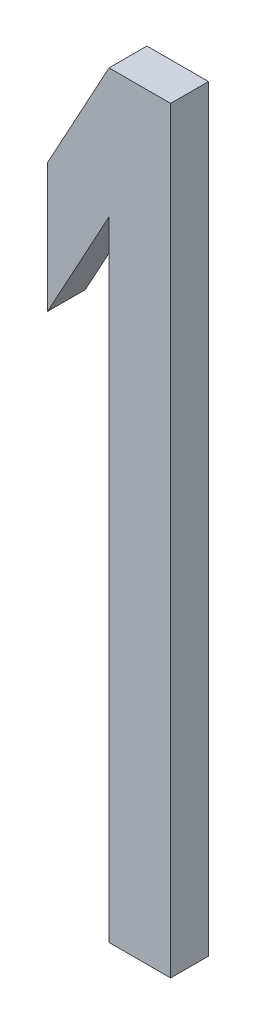
ISO-10303-21;
HEADER;
FILE_DESCRIPTION(('STEP AP214'),'2;1');
FILE_NAME('part.step','',(''),(''),'','','');
FILE_SCHEMA(('AUTOMOTIVE_DESIGN { 1 0 10303 214 1 1 1 1 }'));
ENDSEC;
DATA;
#1=APPLICATION_CONTEXT('core data for automotive mechanical design processes');
#2=APPLICATION_PROTOCOL_DEFINITION('international standard','automotive_design',2000,#1);
#3=PRODUCT_CONTEXT('',#1,'mechanical');
#4=PRODUCT('Part','Part','',(#3));
#5=PRODUCT_RELATED_PRODUCT_CATEGORY('part','',(#4));
#6=PRODUCT_DEFINITION_FORMATION('','',#4);
#7=PRODUCT_DEFINITION_CONTEXT('part definition',#1,'design');
#8=PRODUCT_DEFINITION('design','',#6,#7);
#9=PRODUCT_DEFINITION_SHAPE('','',#8);
#10=(LENGTH_UNIT() NAMED_UNIT(*) SI_UNIT(.MILLI.,.METRE.));
#11=(NAMED_UNIT(*) PLANE_ANGLE_UNIT() SI_UNIT($,.RADIAN.));
#12=(NAMED_UNIT(*) SI_UNIT($,.STERADIAN.) SOLID_ANGLE_UNIT());
#13=UNCERTAINTY_MEASURE_WITH_UNIT(LENGTH_MEASURE(1.E-05),#10,'distance_accuracy_value','');
#14=(GEOMETRIC_REPRESENTATION_CONTEXT(3) GLOBAL_UNCERTAINTY_ASSIGNED_CONTEXT((#13)) GLOBAL_UNIT_ASSIGNED_CONTEXT((#10,
#11,#12)) REPRESENTATION_CONTEXT('',''));
#15=CARTESIAN_POINT('',(0.,0.,0.));
#16=DIRECTION('',(0.,0.,1.));
#17=DIRECTION('',(1.,0.,0.));
#18=AXIS2_PLACEMENT_3D('',#15,#16,#17);
#19=CARTESIAN_POINT('',(33.8564978059574,28.2906710184784,5.9));
#20=DIRECTION('',(0.,0.,1.));
#21=DIRECTION('',(1.,0.,0.));
#22=AXIS2_PLACEMENT_3D('',#19,#20,#21);
#23=PLANE('',#22);
#24=DIRECTION('',(-0.478906914301146,-0.877865688721546,0.));
#25=VECTOR('',#24,1.);
#26=CARTESIAN_POINT('',(34.0189977284774,30.2906710184784,5.9));
#27=LINE('',#26,#25);
#28=CARTESIAN_POINT('',(34.0189977284774,30.2906710184784,5.9));
#29=VERTEX_POINT('',#28);
#30=CARTESIAN_POINT('',(33.8564978059592,29.9927987135674,5.9));
#31=VERTEX_POINT('',#30);
#32=EDGE_CURVE('E82',#29,#31,#27,.T.);
#33=ORIENTED_EDGE('',*,*,#32,.F.);
#34=DIRECTION('',(1.,0.,0.));
#35=VECTOR('',#34,1.);
#36=CARTESIAN_POINT('',(33.8564978059574,30.2906710184784,5.9));
#37=LINE('',#36,#35);
#38=CARTESIAN_POINT('',(34.1814977284774,30.2906710184784,5.9));
#39=VERTEX_POINT('',#38);
#40=EDGE_CURVE('E19',#39,#29,#37,.F.);
#41=ORIENTED_EDGE('',*,*,#40,.F.);
#42=DIRECTION('',(0.,1.,0.));
#43=VECTOR('',#42,1.);
#44=CARTESIAN_POINT('',(34.1814977284774,28.2906710184784,5.9));
#45=LINE('',#44,#43);
#46=CARTESIAN_POINT('',(34.1814977284774,28.2906710184784,5.9));
#47=VERTEX_POINT('',#46);
#48=EDGE_CURVE('E107',#39,#47,#45,.F.);
#49=ORIENTED_EDGE('',*,*,#48,.T.);
#50=DIRECTION('',(1.,0.,0.));
#51=VECTOR('',#50,1.);
#52=CARTESIAN_POINT('',(34.0189977284774,28.2906710184784,5.9));
#53=LINE('',#52,#51);
#54=CARTESIAN_POINT('',(34.0189977284767,28.2906710184784,5.9));
#55=VERTEX_POINT('',#54);
#56=EDGE_CURVE('E102',#47,#55,#53,.F.);
#57=ORIENTED_EDGE('',*,*,#56,.T.);
#58=DIRECTION('',(0.,1.,0.));
#59=VECTOR('',#58,1.);
#60=CARTESIAN_POINT('',(34.0189977284774,29.9502455271484,5.9));
#61=LINE('',#60,#59);
#62=CARTESIAN_POINT('',(34.0189977284753,29.9502455271499,5.9));
#63=VERTEX_POINT('',#62);
#64=EDGE_CURVE('E97',#55,#63,#61,.T.);
#65=ORIENTED_EDGE('',*,*,#64,.T.);
#66=DIRECTION('',(-0.478906766577399,-0.877865769310081,0.));
#67=VECTOR('',#66,1.);
#68=CARTESIAN_POINT('',(33.8564978059574,29.6523731030184,5.9));
#69=LINE('',#68,#67);
#70=CARTESIAN_POINT('',(33.8564978059574,29.6523731030184,5.9));
#71=VERTEX_POINT('',#70);
#72=EDGE_CURVE('E93',#63,#71,#69,.T.);
#73=ORIENTED_EDGE('',*,*,#72,.T.);
#74=DIRECTION('',(0.,1.,0.));
#75=VECTOR('',#74,1.);
#76=CARTESIAN_POINT('',(33.8564978059574,29.9927987135684,5.9));
#77=LINE('',#76,#75);
#78=EDGE_CURVE('E73',#71,#31,#77,.T.);
#79=ORIENTED_EDGE('',*,*,#78,.T.);
#80=EDGE_LOOP('',(#33,#41,#49,#57,#65,#73,#79));
#81=FACE_BOUND('',#80,.T.);
#82=ADVANCED_FACE('F16',(#81),#23,.F.);
#83=CARTESIAN_POINT('',(33.8564978059574,29.9927987135684,6.));
#84=DIRECTION('',(1.,0.,0.));
#85=DIRECTION('',(0.,0.,-1.));
#86=AXIS2_PLACEMENT_3D('',#83,#84,#85);
#87=PLANE('',#86);
#88=DIRECTION('',(0.,0.,1.));
#89=VECTOR('',#88,1.);
#90=CARTESIAN_POINT('',(33.8564978059574,29.6523731030184,6.));
#91=LINE('',#90,#89);
#92=CARTESIAN_POINT('',(33.8564978059574,29.6523731030184,6.));
#93=VERTEX_POINT('',#92);
#94=EDGE_CURVE('E89',#71,#93,#91,.T.);
#95=ORIENTED_EDGE('',*,*,#94,.T.);
#96=DIRECTION('',(0.,1.,0.));
#97=VECTOR('',#96,1.);
#98=CARTESIAN_POINT('',(33.8564978059574,28.2906710184784,6.));
#99=LINE('',#98,#97);
#100=CARTESIAN_POINT('',(33.8564978059592,29.9927987135674,6.));
#101=VERTEX_POINT('',#100);
#102=EDGE_CURVE('E111',#101,#93,#99,.F.);
#103=ORIENTED_EDGE('',*,*,#102,.F.);
#104=DIRECTION('',(0.,0.,1.));
#105=VECTOR('',#104,1.);
#106=CARTESIAN_POINT('',(33.8564978059647,29.9927987135644,6.));
#107=LINE('',#106,#105);
#108=EDGE_CURVE('E87',#101,#31,#107,.F.);
#109=ORIENTED_EDGE('',*,*,#108,.T.);
#110=ORIENTED_EDGE('',*,*,#78,.F.);
#111=EDGE_LOOP('',(#95,#103,#109,#110));
#112=FACE_BOUND('',#111,.T.);
#113=ADVANCED_FACE('F144',(#112),#87,.F.);
#114=CARTESIAN_POINT('',(33.8564978059574,29.6523731030184,6.));
#115=DIRECTION('',(-0.877865769310081,0.478906766577399,0.));
#116=DIRECTION('',(-0.478906766577399,-0.877865769310081,0.));
#117=AXIS2_PLACEMENT_3D('',#114,#115,#116);
#118=PLANE('',#117);
#119=DIRECTION('',(0.,0.,-1.));
#120=VECTOR('',#119,1.);
#121=CARTESIAN_POINT('',(34.0189977284774,29.9502455271499,6.));
#122=LINE('',#121,#120);
#123=CARTESIAN_POINT('',(34.0189977284753,29.9502455271499,6.));
#124=VERTEX_POINT('',#123);
#125=EDGE_CURVE('E95',#63,#124,#122,.F.);
#126=ORIENTED_EDGE('',*,*,#125,.T.);
#127=DIRECTION('',(0.478906766577402,0.87786576931008,0.));
#128=VECTOR('',#127,1.);
#129=CARTESIAN_POINT('',(33.8564978059574,29.6523731030184,6.));
#130=LINE('',#129,#128);
#131=EDGE_CURVE('E114',#93,#124,#130,.T.);
#132=ORIENTED_EDGE('',*,*,#131,.F.);
#133=ORIENTED_EDGE('',*,*,#94,.F.);
#134=ORIENTED_EDGE('',*,*,#72,.F.);
#135=EDGE_LOOP('',(#126,#132,#133,#134));
#136=FACE_BOUND('',#135,.T.);
#137=ADVANCED_FACE('F142',(#136),#118,.F.);
#138=CARTESIAN_POINT('',(34.0189977284774,29.9502455271484,6.));
#139=DIRECTION('',(1.,0.,0.));
#140=DIRECTION('',(0.,0.,-1.));
#141=AXIS2_PLACEMENT_3D('',#138,#139,#140);
#142=PLANE('',#141);
#143=DIRECTION('',(0.,0.,1.));
#144=VECTOR('',#143,1.);
#145=CARTESIAN_POINT('',(34.0189977284774,28.2906710184784,6.));
#146=LINE('',#145,#144);
#147=CARTESIAN_POINT('',(34.0189977284767,28.2906710184784,6.));
#148=VERTEX_POINT('',#147);
#149=EDGE_CURVE('E100',#55,#148,#146,.T.);
#150=ORIENTED_EDGE('',*,*,#149,.T.);
#151=DIRECTION('',(0.,1.,0.));
#152=VECTOR('',#151,1.);
#153=CARTESIAN_POINT('',(34.0189977284746,28.2906710184784,6.));
#154=LINE('',#153,#152);
#155=EDGE_CURVE('E117',#124,#148,#154,.F.);
#156=ORIENTED_EDGE('',*,*,#155,.F.);
#157=ORIENTED_EDGE('',*,*,#125,.F.);
#158=ORIENTED_EDGE('',*,*,#64,.F.);
#159=EDGE_LOOP('',(#150,#156,#157,#158));
#160=FACE_BOUND('',#159,.T.);
#161=ADVANCED_FACE('F139',(#160),#142,.F.);
#162=CARTESIAN_POINT('',(34.0189977284774,28.2906710184784,6.));
#163=DIRECTION('',(0.,1.,0.));
#164=DIRECTION('',(0.,0.,1.));
#165=AXIS2_PLACEMENT_3D('',#162,#163,#164);
#166=PLANE('',#165);
#167=DIRECTION('',(0.,0.,1.));
#168=VECTOR('',#167,1.);
#169=CARTESIAN_POINT('',(34.1814977284774,28.2906710184784,6.));
#170=LINE('',#169,#168);
#171=CARTESIAN_POINT('',(34.1814977284774,28.2906710184784,6.));
#172=VERTEX_POINT('',#171);
#173=EDGE_CURVE('E105',#47,#172,#170,.T.);
#174=ORIENTED_EDGE('',*,*,#173,.T.);
#175=DIRECTION('',(1.,0.,0.));
#176=VECTOR('',#175,1.);
#177=CARTESIAN_POINT('',(33.8564978059574,28.2906710184784,6.));
#178=LINE('',#177,#176);
#179=EDGE_CURVE('E120',#148,#172,#178,.T.);
#180=ORIENTED_EDGE('',*,*,#179,.F.);
#181=ORIENTED_EDGE('',*,*,#149,.F.);
#182=ORIENTED_EDGE('',*,*,#56,.F.);
#183=EDGE_LOOP('',(#174,#180,#181,#182));
#184=FACE_BOUND('',#183,.T.);
#185=ADVANCED_FACE('F136',(#184),#166,.F.);
#186=CARTESIAN_POINT('',(34.1814977284774,28.2906710184784,6.));
#187=DIRECTION('',(-1.,0.,0.));
#188=DIRECTION('',(0.,0.,1.));
#189=AXIS2_PLACEMENT_3D('',#186,#187,#188);
#190=PLANE('',#189);
#191=DIRECTION('',(0.,0.,-1.));
#192=VECTOR('',#191,1.);
#193=CARTESIAN_POINT('',(34.1814977284774,30.2906710184784,6.));
#194=LINE('',#193,#192);
#195=CARTESIAN_POINT('',(34.1814977284774,30.2906710184784,6.));
#196=VERTEX_POINT('',#195);
#197=EDGE_CURVE('E77',#39,#196,#194,.F.);
#198=ORIENTED_EDGE('',*,*,#197,.T.);
#199=DIRECTION('',(0.,1.,0.));
#200=VECTOR('',#199,1.);
#201=CARTESIAN_POINT('',(34.1814977284774,28.2906710184784,6.));
#202=LINE('',#201,#200);
#203=EDGE_CURVE('E123',#172,#196,#202,.T.);
#204=ORIENTED_EDGE('',*,*,#203,.F.);
#205=ORIENTED_EDGE('',*,*,#173,.F.);
#206=ORIENTED_EDGE('',*,*,#48,.F.);
#207=EDGE_LOOP('',(#198,#204,#205,#206));
#208=FACE_BOUND('',#207,.T.);
#209=ADVANCED_FACE('F132',(#208),#190,.F.);
#210=CARTESIAN_POINT('',(34.1814977284774,30.2906710184784,6.));
#211=DIRECTION('',(0.,-1.,0.));
#212=DIRECTION('',(0.,0.,-1.));
#213=AXIS2_PLACEMENT_3D('',#210,#211,#212);
#214=PLANE('',#213);
#215=DIRECTION('',(0.,0.,1.));
#216=VECTOR('',#215,1.);
#217=CARTESIAN_POINT('',(34.0189977284774,30.2906710184784,6.));
#218=LINE('',#217,#216);
#219=CARTESIAN_POINT('',(34.0189977284774,30.2906710184784,6.));
#220=VERTEX_POINT('',#219);
#221=EDGE_CURVE('E34',#29,#220,#218,.T.);
#222=ORIENTED_EDGE('',*,*,#221,.T.);
#223=DIRECTION('',(1.,0.,0.));
#224=VECTOR('',#223,1.);
#225=CARTESIAN_POINT('',(33.8564978059574,30.2906710184784,6.));
#226=LINE('',#225,#224);
#227=EDGE_CURVE('E25',#196,#220,#226,.F.);
#228=ORIENTED_EDGE('',*,*,#227,.F.);
#229=ORIENTED_EDGE('',*,*,#197,.F.);
#230=ORIENTED_EDGE('',*,*,#40,.T.);
#231=EDGE_LOOP('',(#222,#228,#229,#230));
#232=FACE_BOUND('',#231,.T.);
#233=ADVANCED_FACE('F76',(#232),#214,.F.);
#234=CARTESIAN_POINT('',(34.0189977284774,30.2906710184784,6.));
#235=DIRECTION('',(0.877865688733324,-0.478906914279557,0.));
#236=DIRECTION('',(0.478906914279557,0.877865688733324,0.));
#237=AXIS2_PLACEMENT_3D('',#234,#235,#236);
#238=PLANE('',#237);
#239=ORIENTED_EDGE('',*,*,#108,.F.);
#240=DIRECTION('',(-0.478906914301146,-0.877865688721546,0.));
#241=VECTOR('',#240,1.);
#242=CARTESIAN_POINT('',(34.0189977284774,30.2906710184784,6.));
#243=LINE('',#242,#241);
#244=EDGE_CURVE('E11',#220,#101,#243,.T.);
#245=ORIENTED_EDGE('',*,*,#244,.F.);
#246=ORIENTED_EDGE('',*,*,#221,.F.);
#247=ORIENTED_EDGE('',*,*,#32,.T.);
#248=EDGE_LOOP('',(#239,#245,#246,#247));
#249=FACE_BOUND('',#248,.T.);
#250=ADVANCED_FACE('F85',(#249),#238,.F.);
#251=CARTESIAN_POINT('',(33.8564978059574,28.2906710184784,6.));
#252=DIRECTION('',(0.,0.,1.));
#253=DIRECTION('',(1.,0.,0.));
#254=AXIS2_PLACEMENT_3D('',#251,#252,#253);
#255=PLANE('',#254);
#256=ORIENTED_EDGE('',*,*,#227,.T.);
#257=ORIENTED_EDGE('',*,*,#244,.T.);
#258=ORIENTED_EDGE('',*,*,#102,.T.);
#259=ORIENTED_EDGE('',*,*,#131,.T.);
#260=ORIENTED_EDGE('',*,*,#155,.T.);
#261=ORIENTED_EDGE('',*,*,#179,.T.);
#262=ORIENTED_EDGE('',*,*,#203,.T.);
#263=EDGE_LOOP('',(#256,#257,#258,#259,#260,#261,#262));
#264=FACE_BOUND('',#263,.T.);
#265=ADVANCED_FACE('F127',(#264),#255,.T.);
#266=CLOSED_SHELL('',(#82,#113,#137,#161,#185,#209,#233,#250,#265));
#267=MANIFOLD_SOLID_BREP('B1',#266);
#268=ADVANCED_BREP_SHAPE_REPRESENTATION('',(#18,#267),#14);
#269=SHAPE_DEFINITION_REPRESENTATION(#9,#268);
ENDSEC;
END-ISO-10303-21;
